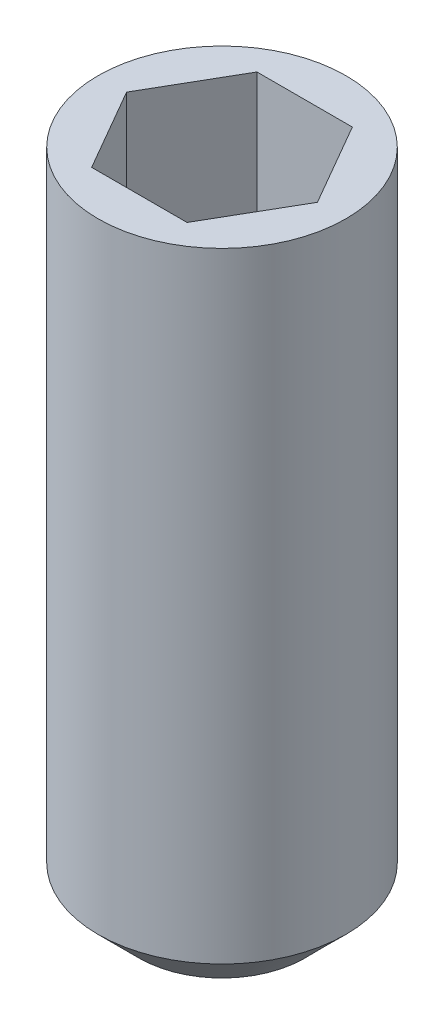
ISO-10303-21;
HEADER;
FILE_DESCRIPTION(('STEP AP214'),'2;1');
FILE_NAME('part.step','',(''),(''),'','','');
FILE_SCHEMA(('AUTOMOTIVE_DESIGN { 1 0 10303 214 1 1 1 1 }'));
ENDSEC;
DATA;
#1=APPLICATION_CONTEXT('core data for automotive mechanical design processes');
#2=APPLICATION_PROTOCOL_DEFINITION('international standard','automotive_design',2000,#1);
#3=PRODUCT_CONTEXT('',#1,'mechanical');
#4=PRODUCT('Part','Part','',(#3));
#5=PRODUCT_RELATED_PRODUCT_CATEGORY('part','',(#4));
#6=PRODUCT_DEFINITION_FORMATION('','',#4);
#7=PRODUCT_DEFINITION_CONTEXT('part definition',#1,'design');
#8=PRODUCT_DEFINITION('design','',#6,#7);
#9=PRODUCT_DEFINITION_SHAPE('','',#8);
#10=(LENGTH_UNIT() NAMED_UNIT(*) SI_UNIT(.MILLI.,.METRE.));
#11=(NAMED_UNIT(*) PLANE_ANGLE_UNIT() SI_UNIT($,.RADIAN.));
#12=(NAMED_UNIT(*) SI_UNIT($,.STERADIAN.) SOLID_ANGLE_UNIT());
#13=UNCERTAINTY_MEASURE_WITH_UNIT(LENGTH_MEASURE(1.E-05),#10,'distance_accuracy_value','');
#14=(GEOMETRIC_REPRESENTATION_CONTEXT(3) GLOBAL_UNCERTAINTY_ASSIGNED_CONTEXT((#13)) GLOBAL_UNIT_ASSIGNED_CONTEXT((#10,
#11,#12)) REPRESENTATION_CONTEXT('',''));
#15=CARTESIAN_POINT('',(0.,0.,0.));
#16=DIRECTION('',(0.,0.,1.));
#17=DIRECTION('',(1.,0.,0.));
#18=AXIS2_PLACEMENT_3D('',#15,#16,#17);
#19=CARTESIAN_POINT('',(0.,8.,0.));
#20=DIRECTION('',(0.,-1.,0.));
#21=DIRECTION('',(0.,0.,-1.));
#22=AXIS2_PLACEMENT_3D('',#19,#20,#21);
#23=CYLINDRICAL_SURFACE('',#22,1.5);
#24=CARTESIAN_POINT('',(0.,0.5,0.));
#25=DIRECTION('',(0.,1.,0.));
#26=DIRECTION('',(0.,0.,1.));
#27=AXIS2_PLACEMENT_3D('',#24,#25,#26);
#28=CIRCLE('',#27,1.5);
#29=CARTESIAN_POINT('',(0.,0.5,1.5));
#30=VERTEX_POINT('',#29);
#31=EDGE_CURVE('E42',#30,#30,#28,.T.);
#32=ORIENTED_EDGE('',*,*,#31,.T.);
#33=EDGE_LOOP('',(#32));
#34=FACE_BOUND('',#33,.T.);
#35=CARTESIAN_POINT('',(0.,8.,0.));
#36=DIRECTION('',(0.,1.,0.));
#37=DIRECTION('',(0.,0.,1.));
#38=AXIS2_PLACEMENT_3D('',#35,#36,#37);
#39=CIRCLE('',#38,1.5);
#40=CARTESIAN_POINT('',(0.,8.,1.5));
#41=VERTEX_POINT('',#40);
#42=EDGE_CURVE('E136',#41,#41,#39,.T.);
#43=ORIENTED_EDGE('',*,*,#42,.F.);
#44=EDGE_LOOP('',(#43));
#45=FACE_BOUND('',#44,.T.);
#46=ADVANCED_FACE('F34',(#34,#45),#23,.T.);
#47=CARTESIAN_POINT('',(0.,8.,0.));
#48=DIRECTION('',(0.,1.,0.));
#49=DIRECTION('',(0.,0.,1.));
#50=AXIS2_PLACEMENT_3D('',#47,#48,#49);
#51=PLANE('',#50);
#52=DIRECTION('',(1.,0.,0.));
#53=VECTOR('',#52,1.);
#54=CARTESIAN_POINT('',(-0.577350269189626,8.,1.));
#55=LINE('',#54,#53);
#56=CARTESIAN_POINT('',(-0.577350269189626,8.,1.));
#57=VERTEX_POINT('',#56);
#58=CARTESIAN_POINT('',(0.577350269189626,8.,1.));
#59=VERTEX_POINT('',#58);
#60=EDGE_CURVE('E49',#57,#59,#55,.T.);
#61=ORIENTED_EDGE('',*,*,#60,.F.);
#62=DIRECTION('',(0.5,0.,0.866025403784439));
#63=VECTOR('',#62,1.);
#64=CARTESIAN_POINT('',(-1.15470053837925,8.,0.));
#65=LINE('',#64,#63);
#66=CARTESIAN_POINT('',(-1.15470053837925,8.,0.));
#67=VERTEX_POINT('',#66);
#68=EDGE_CURVE('E132',#67,#57,#65,.T.);
#69=ORIENTED_EDGE('',*,*,#68,.F.);
#70=DIRECTION('',(-0.5,0.,0.866025403784438));
#71=VECTOR('',#70,1.);
#72=CARTESIAN_POINT('',(-0.577350269189626,8.,-1.));
#73=LINE('',#72,#71);
#74=CARTESIAN_POINT('',(-0.577350269189626,8.,-1.));
#75=VERTEX_POINT('',#74);
#76=EDGE_CURVE('E130',#75,#67,#73,.T.);
#77=ORIENTED_EDGE('',*,*,#76,.F.);
#78=DIRECTION('',(-1.,0.,0.));
#79=VECTOR('',#78,1.);
#80=CARTESIAN_POINT('',(0.577350269189625,8.,-1.));
#81=LINE('',#80,#79);
#82=CARTESIAN_POINT('',(0.577350269189625,8.,-1.));
#83=VERTEX_POINT('',#82);
#84=EDGE_CURVE('E97',#83,#75,#81,.T.);
#85=ORIENTED_EDGE('',*,*,#84,.F.);
#86=DIRECTION('',(-0.5,0.,-0.866025403784438));
#87=VECTOR('',#86,1.);
#88=CARTESIAN_POINT('',(1.15470053837925,8.,0.));
#89=LINE('',#88,#87);
#90=CARTESIAN_POINT('',(1.15470053837925,8.,0.));
#91=VERTEX_POINT('',#90);
#92=EDGE_CURVE('E126',#91,#83,#89,.T.);
#93=ORIENTED_EDGE('',*,*,#92,.F.);
#94=DIRECTION('',(0.5,0.,-0.866025403784439));
#95=VECTOR('',#94,1.);
#96=CARTESIAN_POINT('',(0.577350269189626,8.,1.));
#97=LINE('',#96,#95);
#98=EDGE_CURVE('E123',#59,#91,#97,.T.);
#99=ORIENTED_EDGE('',*,*,#98,.F.);
#100=EDGE_LOOP('',(#61,#69,#77,#85,#93,#99));
#101=FACE_BOUND('',#100,.T.);
#102=ORIENTED_EDGE('',*,*,#42,.T.);
#103=EDGE_LOOP('',(#102));
#104=FACE_BOUND('',#103,.T.);
#105=ADVANCED_FACE('F158',(#101,#104),#51,.T.);
#106=CARTESIAN_POINT('',(0.,0.,0.));
#107=DIRECTION('',(0.,1.,0.));
#108=DIRECTION('',(0.,0.,1.));
#109=AXIS2_PLACEMENT_3D('',#106,#107,#108);
#110=PLANE('',#109);
#111=CARTESIAN_POINT('',(0.,0.,0.));
#112=DIRECTION('',(0.,1.,0.));
#113=DIRECTION('',(0.,0.,1.));
#114=AXIS2_PLACEMENT_3D('',#111,#112,#113);
#115=CIRCLE('',#114,0.999999999999999);
#116=CARTESIAN_POINT('',(0.,0.,0.999999999999999));
#117=VERTEX_POINT('',#116);
#118=EDGE_CURVE('E11',#117,#117,#115,.F.);
#119=ORIENTED_EDGE('',*,*,#118,.T.);
#120=EDGE_LOOP('',(#119));
#121=FACE_BOUND('',#120,.T.);
#122=ADVANCED_FACE('F150',(#121),#110,.F.);
#123=CARTESIAN_POINT('',(0.,0.5,0.));
#124=DIRECTION('',(0.,1.,0.));
#125=DIRECTION('',(0.,0.,1.));
#126=AXIS2_PLACEMENT_3D('',#123,#124,#125);
#127=CONICAL_SURFACE('',#126,1.5,0.785398163397449);
#128=ORIENTED_EDGE('',*,*,#118,.F.);
#129=EDGE_LOOP('',(#128));
#130=FACE_BOUND('',#129,.T.);
#131=ORIENTED_EDGE('',*,*,#31,.F.);
#132=EDGE_LOOP('',(#131));
#133=FACE_BOUND('',#132,.T.);
#134=ADVANCED_FACE('F36',(#130,#133),#127,.T.);
#135=CARTESIAN_POINT('',(-0.577350269189626,6.5,1.));
#136=DIRECTION('',(0.,0.,1.));
#137=DIRECTION('',(1.,0.,0.));
#138=AXIS2_PLACEMENT_3D('',#135,#136,#137);
#139=PLANE('',#138);
#140=ORIENTED_EDGE('',*,*,#60,.T.);
#141=DIRECTION('',(0.,1.,0.));
#142=VECTOR('',#141,1.);
#143=CARTESIAN_POINT('',(0.577350269189626,6.5,1.));
#144=LINE('',#143,#142);
#145=CARTESIAN_POINT('',(0.577350269189626,6.5,1.));
#146=VERTEX_POINT('',#145);
#147=EDGE_CURVE('E79',#146,#59,#144,.T.);
#148=ORIENTED_EDGE('',*,*,#147,.F.);
#149=DIRECTION('',(1.,0.,0.));
#150=VECTOR('',#149,1.);
#151=CARTESIAN_POINT('',(-0.577350269189626,6.5,1.));
#152=LINE('',#151,#150);
#153=CARTESIAN_POINT('',(-0.577350269189626,6.5,1.));
#154=VERTEX_POINT('',#153);
#155=EDGE_CURVE('E134',#154,#146,#152,.T.);
#156=ORIENTED_EDGE('',*,*,#155,.F.);
#157=DIRECTION('',(0.,1.,0.));
#158=VECTOR('',#157,1.);
#159=CARTESIAN_POINT('',(-0.577350269189626,6.5,1.));
#160=LINE('',#159,#158);
#161=EDGE_CURVE('E57',#154,#57,#160,.T.);
#162=ORIENTED_EDGE('',*,*,#161,.T.);
#163=EDGE_LOOP('',(#140,#148,#156,#162));
#164=FACE_BOUND('',#163,.T.);
#165=ADVANCED_FACE('F149',(#164),#139,.F.);
#166=CARTESIAN_POINT('',(-1.15470053837925,6.5,0.));
#167=DIRECTION('',(-0.866025403784439,0.,0.5));
#168=DIRECTION('',(0.5,0.,0.866025403784439));
#169=AXIS2_PLACEMENT_3D('',#166,#167,#168);
#170=PLANE('',#169);
#171=ORIENTED_EDGE('',*,*,#68,.T.);
#172=ORIENTED_EDGE('',*,*,#161,.F.);
#173=DIRECTION('',(0.5,0.,0.866025403784439));
#174=VECTOR('',#173,1.);
#175=CARTESIAN_POINT('',(-1.15470053837925,6.5,0.));
#176=LINE('',#175,#174);
#177=CARTESIAN_POINT('',(-1.15470053837925,6.5,0.));
#178=VERTEX_POINT('',#177);
#179=EDGE_CURVE('E109',#178,#154,#176,.T.);
#180=ORIENTED_EDGE('',*,*,#179,.F.);
#181=DIRECTION('',(0.,1.,0.));
#182=VECTOR('',#181,1.);
#183=CARTESIAN_POINT('',(-1.15470053837925,6.5,0.));
#184=LINE('',#183,#182);
#185=EDGE_CURVE('E101',#178,#67,#184,.T.);
#186=ORIENTED_EDGE('',*,*,#185,.T.);
#187=EDGE_LOOP('',(#171,#172,#180,#186));
#188=FACE_BOUND('',#187,.T.);
#189=ADVANCED_FACE('F156',(#188),#170,.F.);
#190=CARTESIAN_POINT('',(-0.577350269189626,6.5,-1.));
#191=DIRECTION('',(-0.866025403784439,0.,-0.5));
#192=DIRECTION('',(-0.5,0.,0.866025403784439));
#193=AXIS2_PLACEMENT_3D('',#190,#191,#192);
#194=PLANE('',#193);
#195=ORIENTED_EDGE('',*,*,#76,.T.);
#196=ORIENTED_EDGE('',*,*,#185,.F.);
#197=DIRECTION('',(-0.5,0.,0.866025403784438));
#198=VECTOR('',#197,1.);
#199=CARTESIAN_POINT('',(-0.577350269189626,6.5,-1.));
#200=LINE('',#199,#198);
#201=CARTESIAN_POINT('',(-0.577350269189626,6.5,-1.));
#202=VERTEX_POINT('',#201);
#203=EDGE_CURVE('E105',#202,#178,#200,.T.);
#204=ORIENTED_EDGE('',*,*,#203,.F.);
#205=DIRECTION('',(0.,1.,0.));
#206=VECTOR('',#205,1.);
#207=CARTESIAN_POINT('',(-0.577350269189626,6.5,-1.));
#208=LINE('',#207,#206);
#209=EDGE_CURVE('E90',#202,#75,#208,.T.);
#210=ORIENTED_EDGE('',*,*,#209,.T.);
#211=EDGE_LOOP('',(#195,#196,#204,#210));
#212=FACE_BOUND('',#211,.T.);
#213=ADVANCED_FACE('F106',(#212),#194,.F.);
#214=CARTESIAN_POINT('',(0.577350269189625,6.5,-1.));
#215=DIRECTION('',(0.,0.,-1.));
#216=DIRECTION('',(-1.,0.,0.));
#217=AXIS2_PLACEMENT_3D('',#214,#215,#216);
#218=PLANE('',#217);
#219=ORIENTED_EDGE('',*,*,#84,.T.);
#220=ORIENTED_EDGE('',*,*,#209,.F.);
#221=DIRECTION('',(-1.,0.,0.));
#222=VECTOR('',#221,1.);
#223=CARTESIAN_POINT('',(0.577350269189625,6.5,-1.));
#224=LINE('',#223,#222);
#225=CARTESIAN_POINT('',(0.577350269189625,6.5,-1.));
#226=VERTEX_POINT('',#225);
#227=EDGE_CURVE('E94',#226,#202,#224,.T.);
#228=ORIENTED_EDGE('',*,*,#227,.F.);
#229=DIRECTION('',(0.,1.,0.));
#230=VECTOR('',#229,1.);
#231=CARTESIAN_POINT('',(0.577350269189625,6.5,-1.));
#232=LINE('',#231,#230);
#233=EDGE_CURVE('E102',#226,#83,#232,.T.);
#234=ORIENTED_EDGE('',*,*,#233,.T.);
#235=EDGE_LOOP('',(#219,#220,#228,#234));
#236=FACE_BOUND('',#235,.T.);
#237=ADVANCED_FACE('F92',(#236),#218,.F.);
#238=CARTESIAN_POINT('',(1.15470053837925,6.5,0.));
#239=DIRECTION('',(0.866025403784439,0.,-0.5));
#240=DIRECTION('',(-0.5,0.,-0.866025403784439));
#241=AXIS2_PLACEMENT_3D('',#238,#239,#240);
#242=PLANE('',#241);
#243=ORIENTED_EDGE('',*,*,#92,.T.);
#244=ORIENTED_EDGE('',*,*,#233,.F.);
#245=DIRECTION('',(-0.5,0.,-0.866025403784438));
#246=VECTOR('',#245,1.);
#247=CARTESIAN_POINT('',(1.15470053837925,6.5,0.));
#248=LINE('',#247,#246);
#249=CARTESIAN_POINT('',(1.15470053837925,6.5,0.));
#250=VERTEX_POINT('',#249);
#251=EDGE_CURVE('E115',#250,#226,#248,.T.);
#252=ORIENTED_EDGE('',*,*,#251,.F.);
#253=DIRECTION('',(0.,1.,0.));
#254=VECTOR('',#253,1.);
#255=CARTESIAN_POINT('',(1.15470053837925,6.5,0.));
#256=LINE('',#255,#254);
#257=EDGE_CURVE('E139',#250,#91,#256,.T.);
#258=ORIENTED_EDGE('',*,*,#257,.T.);
#259=EDGE_LOOP('',(#243,#244,#252,#258));
#260=FACE_BOUND('',#259,.T.);
#261=ADVANCED_FACE('F172',(#260),#242,.F.);
#262=CARTESIAN_POINT('',(0.577350269189626,6.5,1.));
#263=DIRECTION('',(0.866025403784438,0.,0.5));
#264=DIRECTION('',(0.5,0.,-0.866025403784439));
#265=AXIS2_PLACEMENT_3D('',#262,#263,#264);
#266=PLANE('',#265);
#267=ORIENTED_EDGE('',*,*,#98,.T.);
#268=ORIENTED_EDGE('',*,*,#257,.F.);
#269=DIRECTION('',(0.5,0.,-0.866025403784439));
#270=VECTOR('',#269,1.);
#271=CARTESIAN_POINT('',(0.577350269189626,6.5,1.));
#272=LINE('',#271,#270);
#273=EDGE_CURVE('E117',#146,#250,#272,.T.);
#274=ORIENTED_EDGE('',*,*,#273,.F.);
#275=ORIENTED_EDGE('',*,*,#147,.T.);
#276=EDGE_LOOP('',(#267,#268,#274,#275));
#277=FACE_BOUND('',#276,.T.);
#278=ADVANCED_FACE('F169',(#277),#266,.F.);
#279=CARTESIAN_POINT('',(0.,6.5,0.));
#280=DIRECTION('',(0.,1.,0.));
#281=DIRECTION('',(0.,0.,1.));
#282=AXIS2_PLACEMENT_3D('',#279,#280,#281);
#283=PLANE('',#282);
#284=ORIENTED_EDGE('',*,*,#155,.T.);
#285=ORIENTED_EDGE('',*,*,#273,.T.);
#286=ORIENTED_EDGE('',*,*,#251,.T.);
#287=ORIENTED_EDGE('',*,*,#227,.T.);
#288=ORIENTED_EDGE('',*,*,#203,.T.);
#289=ORIENTED_EDGE('',*,*,#179,.T.);
#290=EDGE_LOOP('',(#284,#285,#286,#287,#288,#289));
#291=FACE_BOUND('',#290,.T.);
#292=ADVANCED_FACE('F112',(#291),#283,.T.);
#293=CLOSED_SHELL('',(#46,#105,#122,#134,#165,#189,#213,#237,#261,#278,#292));
#294=MANIFOLD_SOLID_BREP('B2',#293);
#295=ADVANCED_BREP_SHAPE_REPRESENTATION('',(#18,#294),#14);
#296=SHAPE_DEFINITION_REPRESENTATION(#9,#295);
ENDSEC;
END-ISO-10303-21;
